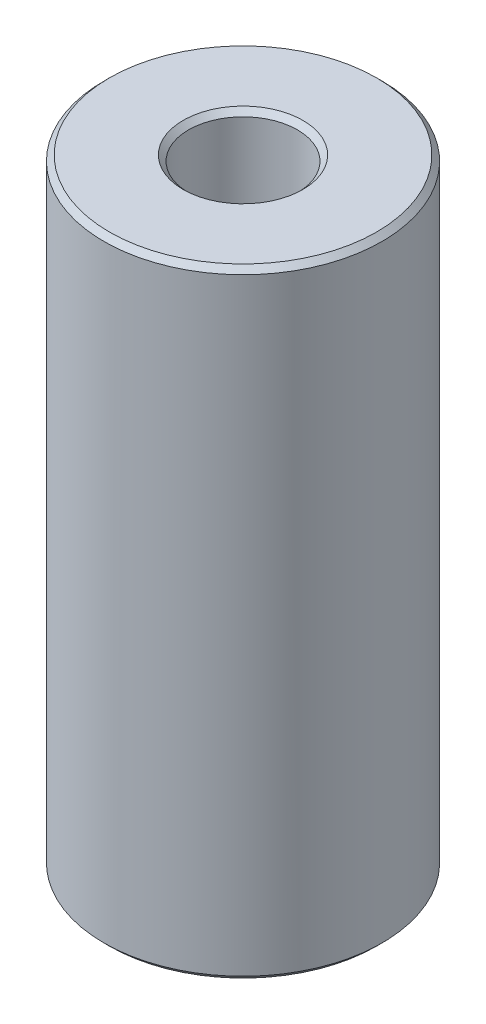
ISO-10303-21;
HEADER;
FILE_DESCRIPTION(('STEP AP214'),'2;1');
FILE_NAME('part.step','',(''),(''),'','','');
FILE_SCHEMA(('AUTOMOTIVE_DESIGN { 1 0 10303 214 1 1 1 1 }'));
ENDSEC;
DATA;
#1=APPLICATION_CONTEXT('core data for automotive mechanical design processes');
#2=APPLICATION_PROTOCOL_DEFINITION('international standard','automotive_design',2000,#1);
#3=PRODUCT_CONTEXT('',#1,'mechanical');
#4=PRODUCT('Part','Part','',(#3));
#5=PRODUCT_RELATED_PRODUCT_CATEGORY('part','',(#4));
#6=PRODUCT_DEFINITION_FORMATION('','',#4);
#7=PRODUCT_DEFINITION_CONTEXT('part definition',#1,'design');
#8=PRODUCT_DEFINITION('design','',#6,#7);
#9=PRODUCT_DEFINITION_SHAPE('','',#8);
#10=(LENGTH_UNIT() NAMED_UNIT(*) SI_UNIT(.MILLI.,.METRE.));
#11=(NAMED_UNIT(*) PLANE_ANGLE_UNIT() SI_UNIT($,.RADIAN.));
#12=(NAMED_UNIT(*) SI_UNIT($,.STERADIAN.) SOLID_ANGLE_UNIT());
#13=UNCERTAINTY_MEASURE_WITH_UNIT(LENGTH_MEASURE(1.E-05),#10,'distance_accuracy_value','');
#14=(GEOMETRIC_REPRESENTATION_CONTEXT(3) GLOBAL_UNCERTAINTY_ASSIGNED_CONTEXT((#13)) GLOBAL_UNIT_ASSIGNED_CONTEXT((#10,
#11,#12)) REPRESENTATION_CONTEXT('',''));
#15=CARTESIAN_POINT('',(0.,0.,0.));
#16=DIRECTION('',(0.,0.,1.));
#17=DIRECTION('',(1.,0.,0.));
#18=AXIS2_PLACEMENT_3D('',#15,#16,#17);
#19=CARTESIAN_POINT('',(0.,55.6069364582051,0.));
#20=DIRECTION('',(0.,-1.,0.));
#21=DIRECTION('',(0.,0.,-1.));
#22=AXIS2_PLACEMENT_3D('',#19,#20,#21);
#23=CYLINDRICAL_SURFACE('',#22,12.5);
#24=CARTESIAN_POINT('',(0.,0.490488283400307,0.));
#25=DIRECTION('',(0.,1.,0.));
#26=DIRECTION('',(0.,0.,1.));
#27=AXIS2_PLACEMENT_3D('',#24,#25,#26);
#28=CIRCLE('',#27,12.5);
#29=CARTESIAN_POINT('',(0.,0.490488283400307,-12.5));
#30=VERTEX_POINT('',#29);
#31=EDGE_CURVE('E10',#30,#30,#28,.T.);
#32=CARTESIAN_POINT('',(0.,55.1164481748048,0.));
#33=DIRECTION('',(0.,1.,0.));
#34=DIRECTION('',(0.,0.,1.));
#35=AXIS2_PLACEMENT_3D('',#32,#33,#34);
#36=CIRCLE('',#35,12.5);
#37=CARTESIAN_POINT('',(0.,55.1164481748048,-12.5));
#38=VERTEX_POINT('',#37);
#39=EDGE_CURVE('E50',#38,#38,#36,.F.);
#40=CARTESIAN_POINT('',(0.,0.490488283400307,-12.5));
#41=CARTESIAN_POINT('',(0.,1.05950869893577,-12.5));
#42=CARTESIAN_POINT('',(0.,1.62852911447123,-12.5));
#43=CARTESIAN_POINT('',(0.,2.76656994554216,-12.5));
#44=CARTESIAN_POINT('',(0.,3.33559036107763,-12.5));
#45=CARTESIAN_POINT('',(0.,4.47363119214855,-12.5));
#46=CARTESIAN_POINT('',(0.,5.04265160768402,-12.5));
#47=CARTESIAN_POINT('',(0.,6.18069243875494,-12.5));
#48=CARTESIAN_POINT('',(0.,6.74971285429041,-12.5));
#49=CARTESIAN_POINT('',(0.,7.88775368536134,-12.5));
#50=CARTESIAN_POINT('',(0.,8.4567741008968,-12.5));
#51=CARTESIAN_POINT('',(0.,9.59481493196773,-12.5));
#52=CARTESIAN_POINT('',(0.,10.1638353475032,-12.5));
#53=CARTESIAN_POINT('',(0.,11.3018761785741,-12.5));
#54=CARTESIAN_POINT('',(0.,11.8708965941096,-12.5));
#55=CARTESIAN_POINT('',(0.,13.0089374251805,-12.5));
#56=CARTESIAN_POINT('',(0.,13.577957840716,-12.5));
#57=CARTESIAN_POINT('',(0.,14.7159986717869,-12.5));
#58=CARTESIAN_POINT('',(0.,15.2850190873224,-12.5));
#59=CARTESIAN_POINT('',(0.,16.4230599183933,-12.5));
#60=CARTESIAN_POINT('',(0.,16.9920803339288,-12.5));
#61=CARTESIAN_POINT('',(0.,18.1301211649997,-12.5));
#62=CARTESIAN_POINT('',(0.,18.6991415805352,-12.5));
#63=CARTESIAN_POINT('',(0.,19.8371824116061,-12.5));
#64=CARTESIAN_POINT('',(0.,20.4062028271415,-12.5));
#65=CARTESIAN_POINT('',(0.,21.5442436582125,-12.5));
#66=CARTESIAN_POINT('',(0.,22.1132640737479,-12.5));
#67=CARTESIAN_POINT('',(0.,23.2513049048189,-12.5));
#68=CARTESIAN_POINT('',(0.,23.8203253203543,-12.5));
#69=CARTESIAN_POINT('',(0.,24.9583661514253,-12.5));
#70=CARTESIAN_POINT('',(0.,25.5273865669607,-12.5));
#71=CARTESIAN_POINT('',(0.,26.6654273980316,-12.5));
#72=CARTESIAN_POINT('',(0.,27.2344478135671,-12.5));
#73=CARTESIAN_POINT('',(0.,28.372488644638,-12.5));
#74=CARTESIAN_POINT('',(0.,28.9415090601735,-12.5));
#75=CARTESIAN_POINT('',(0.,30.0795498912444,-12.5));
#76=CARTESIAN_POINT('',(0.,30.6485703067799,-12.5));
#77=CARTESIAN_POINT('',(0.,31.7866111378508,-12.5));
#78=CARTESIAN_POINT('',(0.,32.3556315533863,-12.5));
#79=CARTESIAN_POINT('',(0.,33.4936723844572,-12.5));
#80=CARTESIAN_POINT('',(0.,34.0626927999927,-12.5));
#81=CARTESIAN_POINT('',(0.,35.2007336310636,-12.5));
#82=CARTESIAN_POINT('',(0.,35.7697540465991,-12.5));
#83=CARTESIAN_POINT('',(0.,36.90779487767,-12.5));
#84=CARTESIAN_POINT('',(0.,37.4768152932055,-12.5));
#85=CARTESIAN_POINT('',(0.,38.6148561242764,-12.5));
#86=CARTESIAN_POINT('',(0.,39.1838765398118,-12.5));
#87=CARTESIAN_POINT('',(0.,40.3219173708828,-12.5));
#88=CARTESIAN_POINT('',(0.,40.8909377864182,-12.5));
#89=CARTESIAN_POINT('',(0.,42.0289786174892,-12.5));
#90=CARTESIAN_POINT('',(0.,42.5979990330246,-12.5));
#91=CARTESIAN_POINT('',(0.,43.7360398640956,-12.5));
#92=CARTESIAN_POINT('',(0.,44.305060279631,-12.5));
#93=CARTESIAN_POINT('',(0.,45.4431011107019,-12.5));
#94=CARTESIAN_POINT('',(0.,46.0121215262374,-12.5));
#95=CARTESIAN_POINT('',(0.,47.1501623573083,-12.5));
#96=CARTESIAN_POINT('',(0.,47.7191827728438,-12.5));
#97=CARTESIAN_POINT('',(0.,48.8572236039147,-12.5));
#98=CARTESIAN_POINT('',(0.,49.4262440194502,-12.5));
#99=CARTESIAN_POINT('',(0.,50.5642848505211,-12.5));
#100=CARTESIAN_POINT('',(0.,51.1333052660566,-12.5));
#101=CARTESIAN_POINT('',(0.,52.2713460971275,-12.5));
#102=CARTESIAN_POINT('',(0.,52.840366512663,-12.5));
#103=CARTESIAN_POINT('',(0.,53.9784073437339,-12.5));
#104=CARTESIAN_POINT('',(0.,54.5474277592694,-12.5));
#105=CARTESIAN_POINT('',(0.,55.1164481748048,-12.5));
#106=B_SPLINE_CURVE_WITH_KNOTS('',3,(#40,#41,#42,#43,#44,#45,#46,#47,#48,#49,#50,#51,#52,#53,
#54,#55,#56,#57,#58,#59,#60,#61,#62,#63,#64,#65,#66,#67,#68,#69,#70,#71,#72,#73,#74,#75,#76,#77,
#78,#79,#80,#81,#82,#83,#84,#85,#86,#87,#88,#89,#90,#91,#92,#93,#94,#95,#96,#97,#98,#99,#100,
#101,#102,#103,#104,#105),.UNSPECIFIED.,.F.,.F.,(4,2,2,2,2,2,2,2,2,2,2,2,2,2,2,2,2,2,2,2,2,2,2,
2,2,2,2,2,2,2,2,2,4),(0.,1.70706124660639,3.41412249321278,5.12118373981917,6.82824498642556,
8.53530623303196,10.2423674796384,11.9494287262447,13.6564899728511,15.3635512194575,
17.0706124660639,18.7776737126703,20.4847349592767,22.1917962058831,23.8988574524895,
25.6059186990959,27.3129799457023,29.0200411923087,30.727102438915,32.4341636855214,
34.1412249321278,35.8482861787342,37.5553474253406,39.262408671947,40.9694699185534,
42.6765311651598,44.3835924117662,46.0906536583726,47.797714904979,49.5047761515854,
51.2118373981917,52.9188986447981,54.6259598914045),.UNSPECIFIED.);
#107=EDGE_CURVE('BSEAM39',#30,#38,#106,.T.);
#108=ORIENTED_EDGE('',*,*,#31,.T.);
#109=ORIENTED_EDGE('',*,*,#39,.T.);
#110=ORIENTED_EDGE('',*,*,#107,.T.);
#111=ORIENTED_EDGE('',*,*,#107,.F.);
#112=EDGE_LOOP('',(#108,#110,#109,#111));
#113=FACE_BOUND('',#112,.T.);
#114=ADVANCED_FACE('F39',(#113),#23,.T.);
#115=CARTESIAN_POINT('',(0.,55.6069364582051,0.));
#116=DIRECTION('',(0.,1.,0.));
#117=DIRECTION('',(0.,0.,1.));
#118=AXIS2_PLACEMENT_3D('',#115,#116,#117);
#119=PLANE('',#118);
#120=CARTESIAN_POINT('',(0.,55.6069364582051,0.));
#121=DIRECTION('',(0.,1.,0.));
#122=DIRECTION('',(0.,0.,1.));
#123=AXIS2_PLACEMENT_3D('',#120,#121,#122);
#124=CIRCLE('',#123,5.38509225593912);
#125=CARTESIAN_POINT('',(0.,55.6069364582051,5.38509225593912));
#126=VERTEX_POINT('',#125);
#127=EDGE_CURVE('E58',#126,#126,#124,.F.);
#128=ORIENTED_EDGE('',*,*,#127,.T.);
#129=EDGE_LOOP('',(#128));
#130=FACE_BOUND('',#129,.T.);
#131=CARTESIAN_POINT('',(0.,55.6069364582051,0.));
#132=DIRECTION('',(0.,1.,0.));
#133=DIRECTION('',(0.,0.,1.));
#134=AXIS2_PLACEMENT_3D('',#131,#132,#133);
#135=CIRCLE('',#134,12.0095117165997);
#136=CARTESIAN_POINT('',(0.,55.6069364582051,12.0095117165997));
#137=VERTEX_POINT('',#136);
#138=EDGE_CURVE('E61',#137,#137,#135,.T.);
#139=ORIENTED_EDGE('',*,*,#138,.T.);
#140=EDGE_LOOP('',(#139));
#141=FACE_BOUND('',#140,.T.);
#142=ADVANCED_FACE('F88',(#130,#141),#119,.T.);
#143=CARTESIAN_POINT('',(0.,0.,0.));
#144=DIRECTION('',(0.,1.,0.));
#145=DIRECTION('',(0.,0.,1.));
#146=AXIS2_PLACEMENT_3D('',#143,#144,#145);
#147=PLANE('',#146);
#148=CARTESIAN_POINT('',(0.,0.,0.));
#149=DIRECTION('',(0.,1.,0.));
#150=DIRECTION('',(0.,0.,1.));
#151=AXIS2_PLACEMENT_3D('',#148,#149,#150);
#152=CIRCLE('',#151,5.38509225593908);
#153=CARTESIAN_POINT('',(0.,0.,5.38509225593908));
#154=VERTEX_POINT('',#153);
#155=EDGE_CURVE('E51',#154,#154,#152,.T.);
#156=ORIENTED_EDGE('',*,*,#155,.T.);
#157=EDGE_LOOP('',(#156));
#158=FACE_BOUND('',#157,.T.);
#159=CARTESIAN_POINT('',(0.,0.,0.));
#160=DIRECTION('',(0.,1.,0.));
#161=DIRECTION('',(0.,0.,1.));
#162=AXIS2_PLACEMENT_3D('',#159,#160,#161);
#163=CIRCLE('',#162,12.0095117165997);
#164=CARTESIAN_POINT('',(0.,0.,12.0095117165997));
#165=VERTEX_POINT('',#164);
#166=EDGE_CURVE('E54',#165,#165,#163,.F.);
#167=ORIENTED_EDGE('',*,*,#166,.T.);
#168=EDGE_LOOP('',(#167));
#169=FACE_BOUND('',#168,.T.);
#170=ADVANCED_FACE('F83',(#158,#169),#147,.F.);
#171=CARTESIAN_POINT('',(0.,55.6069364582051,0.));
#172=DIRECTION('',(0.,-1.,0.));
#173=DIRECTION('',(0.,0.,-1.));
#174=AXIS2_PLACEMENT_3D('',#171,#172,#173);
#175=CYLINDRICAL_SURFACE('',#174,4.89460397253881);
#176=CARTESIAN_POINT('',(0.,55.1164481748048,0.));
#177=DIRECTION('',(0.,1.,0.));
#178=DIRECTION('',(0.,0.,1.));
#179=AXIS2_PLACEMENT_3D('',#176,#177,#178);
#180=CIRCLE('',#179,4.89460397253881);
#181=CARTESIAN_POINT('',(0.,55.1164481748048,-4.89460397253881));
#182=VERTEX_POINT('',#181);
#183=EDGE_CURVE('E67',#182,#182,#180,.T.);
#184=CARTESIAN_POINT('',(0.,0.490488283400273,0.));
#185=DIRECTION('',(0.,1.,0.));
#186=DIRECTION('',(0.,0.,1.));
#187=AXIS2_PLACEMENT_3D('',#184,#185,#186);
#188=CIRCLE('',#187,4.89460397253881);
#189=CARTESIAN_POINT('',(0.,0.490488283400266,-4.89460397253881));
#190=VERTEX_POINT('',#189);
#191=EDGE_CURVE('E69',#190,#190,#188,.F.);
#192=CARTESIAN_POINT('',(0.,55.1164481748048,-4.89460397253881));
#193=CARTESIAN_POINT('',(0.,54.5474277592693,-4.89460397253881));
#194=CARTESIAN_POINT('',(0.,53.9784073437339,-4.89460397253881));
#195=CARTESIAN_POINT('',(0.,52.8403665126629,-4.89460397253881));
#196=CARTESIAN_POINT('',(0.,52.2713460971275,-4.89460397253881));
#197=CARTESIAN_POINT('',(0.,51.1333052660566,-4.89460397253881));
#198=CARTESIAN_POINT('',(0.,50.5642848505211,-4.89460397253881));
#199=CARTESIAN_POINT('',(0.,49.4262440194502,-4.89460397253881));
#200=CARTESIAN_POINT('',(0.,48.8572236039147,-4.89460397253881));
#201=CARTESIAN_POINT('',(0.,47.7191827728438,-4.89460397253881));
#202=CARTESIAN_POINT('',(0.,47.1501623573083,-4.89460397253881));
#203=CARTESIAN_POINT('',(0.,46.0121215262374,-4.89460397253881));
#204=CARTESIAN_POINT('',(0.,45.4431011107019,-4.89460397253881));
#205=CARTESIAN_POINT('',(0.,44.305060279631,-4.89460397253881));
#206=CARTESIAN_POINT('',(0.,43.7360398640955,-4.89460397253881));
#207=CARTESIAN_POINT('',(0.,42.5979990330246,-4.89460397253881));
#208=CARTESIAN_POINT('',(0.,42.0289786174891,-4.89460397253881));
#209=CARTESIAN_POINT('',(0.,40.8909377864182,-4.89460397253881));
#210=CARTESIAN_POINT('',(0.,40.3219173708827,-4.89460397253881));
#211=CARTESIAN_POINT('',(0.,39.1838765398118,-4.89460397253881));
#212=CARTESIAN_POINT('',(0.,38.6148561242764,-4.89460397253881));
#213=CARTESIAN_POINT('',(0.,37.4768152932054,-4.89460397253881));
#214=CARTESIAN_POINT('',(0.,36.90779487767,-4.89460397253881));
#215=CARTESIAN_POINT('',(0.,35.769754046599,-4.89460397253881));
#216=CARTESIAN_POINT('',(0.,35.2007336310636,-4.89460397253881));
#217=CARTESIAN_POINT('',(0.,34.0626927999926,-4.89460397253881));
#218=CARTESIAN_POINT('',(0.,33.4936723844572,-4.89460397253881));
#219=CARTESIAN_POINT('',(0.,32.3556315533862,-4.89460397253881));
#220=CARTESIAN_POINT('',(0.,31.7866111378508,-4.89460397253881));
#221=CARTESIAN_POINT('',(0.,30.6485703067799,-4.89460397253881));
#222=CARTESIAN_POINT('',(0.,30.0795498912444,-4.89460397253881));
#223=CARTESIAN_POINT('',(0.,28.9415090601735,-4.89460397253881));
#224=CARTESIAN_POINT('',(0.,28.372488644638,-4.89460397253881));
#225=CARTESIAN_POINT('',(0.,27.2344478135671,-4.89460397253881));
#226=CARTESIAN_POINT('',(0.,26.6654273980316,-4.89460397253881));
#227=CARTESIAN_POINT('',(0.,25.5273865669607,-4.89460397253881));
#228=CARTESIAN_POINT('',(0.,24.9583661514252,-4.89460397253881));
#229=CARTESIAN_POINT('',(0.,23.8203253203543,-4.89460397253881));
#230=CARTESIAN_POINT('',(0.,23.2513049048188,-4.89460397253881));
#231=CARTESIAN_POINT('',(0.,22.1132640737479,-4.89460397253881));
#232=CARTESIAN_POINT('',(0.,21.5442436582124,-4.89460397253881));
#233=CARTESIAN_POINT('',(0.,20.4062028271415,-4.89460397253881));
#234=CARTESIAN_POINT('',(0.,19.837182411606,-4.89460397253881));
#235=CARTESIAN_POINT('',(0.,18.6991415805351,-4.89460397253881));
#236=CARTESIAN_POINT('',(0.,18.1301211649997,-4.89460397253881));
#237=CARTESIAN_POINT('',(0.,16.9920803339287,-4.89460397253881));
#238=CARTESIAN_POINT('',(0.,16.4230599183933,-4.89460397253881));
#239=CARTESIAN_POINT('',(0.,15.2850190873223,-4.89460397253881));
#240=CARTESIAN_POINT('',(0.,14.7159986717869,-4.89460397253881));
#241=CARTESIAN_POINT('',(0.,13.5779578407159,-4.89460397253881));
#242=CARTESIAN_POINT('',(0.,13.0089374251805,-4.89460397253881));
#243=CARTESIAN_POINT('',(0.,11.8708965941095,-4.89460397253881));
#244=CARTESIAN_POINT('',(0.,11.3018761785741,-4.89460397253881));
#245=CARTESIAN_POINT('',(0.,10.1638353475032,-4.89460397253881));
#246=CARTESIAN_POINT('',(0.,9.59481493196769,-4.89460397253881));
#247=CARTESIAN_POINT('',(0.,8.45677410089676,-4.89460397253881));
#248=CARTESIAN_POINT('',(0.,7.8877536853613,-4.89460397253881));
#249=CARTESIAN_POINT('',(0.,6.74971285429037,-4.89460397253881));
#250=CARTESIAN_POINT('',(0.,6.1806924387549,-4.89460397253881));
#251=CARTESIAN_POINT('',(0.,5.04265160768397,-4.89460397253881));
#252=CARTESIAN_POINT('',(0.,4.47363119214851,-4.89460397253881));
#253=CARTESIAN_POINT('',(0.,3.33559036107758,-4.89460397253881));
#254=CARTESIAN_POINT('',(0.,2.76656994554212,-4.89460397253881));
#255=CARTESIAN_POINT('',(0.,1.62852911447119,-4.89460397253881));
#256=CARTESIAN_POINT('',(0.,1.05950869893573,-4.89460397253881));
#257=CARTESIAN_POINT('',(0.,0.490488283400266,-4.89460397253881));
#258=B_SPLINE_CURVE_WITH_KNOTS('',3,(#192,#193,#194,#195,#196,#197,#198,#199,#200,#201,#202,
#203,#204,#205,#206,#207,#208,#209,#210,#211,#212,#213,#214,#215,#216,#217,#218,#219,#220,#221,
#222,#223,#224,#225,#226,#227,#228,#229,#230,#231,#232,#233,#234,#235,#236,#237,#238,#239,#240,
#241,#242,#243,#244,#245,#246,#247,#248,#249,#250,#251,#252,#253,#254,#255,#256,#257),
.UNSPECIFIED.,.F.,.F.,(4,2,2,2,2,2,2,2,2,2,2,2,2,2,2,2,2,2,2,2,2,2,2,2,2,2,2,2,2,2,2,2,4),(0.,
1.70706124660639,3.41412249321278,5.12118373981917,6.82824498642556,8.53530623303195,
10.2423674796383,11.9494287262447,13.6564899728511,15.3635512194575,17.0706124660639,
18.7776737126703,20.4847349592767,22.1917962058831,23.8988574524895,25.6059186990959,
27.3129799457023,29.0200411923087,30.7271024389151,32.4341636855214,34.1412249321278,
35.8482861787342,37.5553474253406,39.262408671947,40.9694699185534,42.6765311651598,
44.3835924117662,46.0906536583726,47.797714904979,49.5047761515854,51.2118373981918,
52.9188986447981,54.6259598914045),.UNSPECIFIED.);
#259=EDGE_CURVE('BSEAM71',#182,#190,#258,.T.);
#260=ORIENTED_EDGE('',*,*,#183,.T.);
#261=ORIENTED_EDGE('',*,*,#191,.T.);
#262=ORIENTED_EDGE('',*,*,#259,.T.);
#263=ORIENTED_EDGE('',*,*,#259,.F.);
#264=EDGE_LOOP('',(#260,#262,#261,#263));
#265=FACE_BOUND('',#264,.T.);
#266=ADVANCED_FACE('F71',(#265),#175,.F.);
#267=CARTESIAN_POINT('',(0.,55.1164481748048,0.));
#268=DIRECTION('',(0.,1.,0.));
#269=DIRECTION('',(0.,0.,1.));
#270=AXIS2_PLACEMENT_3D('',#267,#268,#269);
#271=CONICAL_SURFACE('',#270,4.89460397253881,0.785398163397451);
#272=ORIENTED_EDGE('',*,*,#127,.F.);
#273=EDGE_LOOP('',(#272));
#274=FACE_BOUND('',#273,.T.);
#275=ORIENTED_EDGE('',*,*,#183,.F.);
#276=EDGE_LOOP('',(#275));
#277=FACE_BOUND('',#276,.T.);
#278=ADVANCED_FACE('F77',(#274,#277),#271,.F.);
#279=CARTESIAN_POINT('',(0.,0.,0.));
#280=DIRECTION('',(0.,-1.,0.));
#281=DIRECTION('',(0.,0.,-1.));
#282=AXIS2_PLACEMENT_3D('',#279,#280,#281);
#283=CONICAL_SURFACE('',#282,5.38509225593908,0.785398163397444);
#284=ORIENTED_EDGE('',*,*,#191,.F.);
#285=EDGE_LOOP('',(#284));
#286=FACE_BOUND('',#285,.T.);
#287=ORIENTED_EDGE('',*,*,#155,.F.);
#288=EDGE_LOOP('',(#287));
#289=FACE_BOUND('',#288,.T.);
#290=ADVANCED_FACE('F73',(#286,#289),#283,.F.);
#291=CARTESIAN_POINT('',(0.,0.490488283400307,0.));
#292=DIRECTION('',(0.,1.,0.));
#293=DIRECTION('',(0.,0.,1.));
#294=AXIS2_PLACEMENT_3D('',#291,#292,#293);
#295=CONICAL_SURFACE('',#294,12.5,0.785398163397454);
#296=ORIENTED_EDGE('',*,*,#166,.F.);
#297=EDGE_LOOP('',(#296));
#298=FACE_BOUND('',#297,.T.);
#299=ORIENTED_EDGE('',*,*,#31,.F.);
#300=EDGE_LOOP('',(#299));
#301=FACE_BOUND('',#300,.T.);
#302=ADVANCED_FACE('F76',(#298,#301),#295,.T.);
#303=CARTESIAN_POINT('',(0.,55.6069364582051,0.));
#304=DIRECTION('',(0.,-1.,0.));
#305=DIRECTION('',(0.,0.,-1.));
#306=AXIS2_PLACEMENT_3D('',#303,#304,#305);
#307=CONICAL_SURFACE('',#306,12.0095117165997,0.785398163397439);
#308=ORIENTED_EDGE('',*,*,#39,.F.);
#309=EDGE_LOOP('',(#308));
#310=FACE_BOUND('',#309,.T.);
#311=ORIENTED_EDGE('',*,*,#138,.F.);
#312=EDGE_LOOP('',(#311));
#313=FACE_BOUND('',#312,.T.);
#314=ADVANCED_FACE('F45',(#310,#313),#307,.T.);
#315=CLOSED_SHELL('',(#114,#142,#170,#266,#278,#290,#302,#314));
#316=MANIFOLD_SOLID_BREP('B2',#315);
#317=ADVANCED_BREP_SHAPE_REPRESENTATION('',(#18,#316),#14);
#318=SHAPE_DEFINITION_REPRESENTATION(#9,#317);
ENDSEC;
END-ISO-10303-21;
